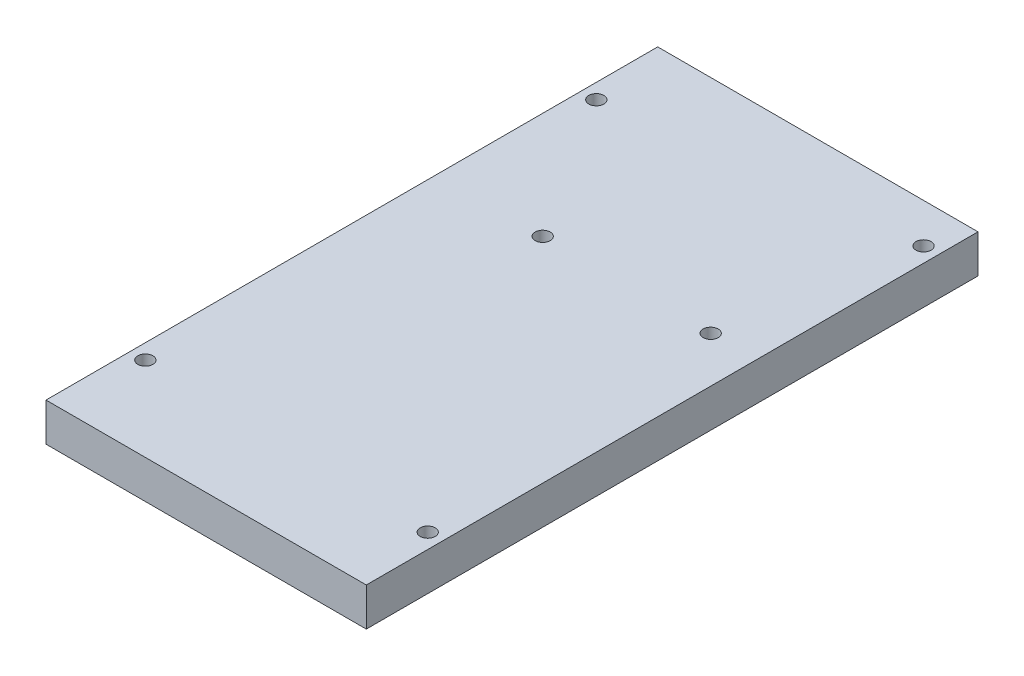
ISO-10303-21;
HEADER;
FILE_DESCRIPTION(('STEP AP214'),'2;1');
FILE_NAME('part.step','',(''),(''),'','','');
FILE_SCHEMA(('AUTOMOTIVE_DESIGN { 1 0 10303 214 1 1 1 1 }'));
ENDSEC;
DATA;
#1=APPLICATION_CONTEXT('core data for automotive mechanical design processes');
#2=APPLICATION_PROTOCOL_DEFINITION('international standard','automotive_design',2000,#1);
#3=PRODUCT_CONTEXT('',#1,'mechanical');
#4=PRODUCT('Part','Part','',(#3));
#5=PRODUCT_RELATED_PRODUCT_CATEGORY('part','',(#4));
#6=PRODUCT_DEFINITION_FORMATION('','',#4);
#7=PRODUCT_DEFINITION_CONTEXT('part definition',#1,'design');
#8=PRODUCT_DEFINITION('design','',#6,#7);
#9=PRODUCT_DEFINITION_SHAPE('','',#8);
#10=(LENGTH_UNIT() NAMED_UNIT(*) SI_UNIT(.MILLI.,.METRE.));
#11=(NAMED_UNIT(*) PLANE_ANGLE_UNIT() SI_UNIT($,.RADIAN.));
#12=(NAMED_UNIT(*) SI_UNIT($,.STERADIAN.) SOLID_ANGLE_UNIT());
#13=UNCERTAINTY_MEASURE_WITH_UNIT(LENGTH_MEASURE(1.E-05),#10,'distance_accuracy_value','');
#14=(GEOMETRIC_REPRESENTATION_CONTEXT(3) GLOBAL_UNCERTAINTY_ASSIGNED_CONTEXT((#13)) GLOBAL_UNIT_ASSIGNED_CONTEXT((#10,
#11,#12)) REPRESENTATION_CONTEXT('',''));
#15=CARTESIAN_POINT('',(0.,0.,0.));
#16=DIRECTION('',(0.,0.,1.));
#17=DIRECTION('',(1.,0.,0.));
#18=AXIS2_PLACEMENT_3D('',#15,#16,#17);
#19=CARTESIAN_POINT('',(0.,6.35,0.));
#20=DIRECTION('',(0.,1.,0.));
#21=DIRECTION('',(0.,0.,1.));
#22=AXIS2_PLACEMENT_3D('',#19,#20,#21);
#23=PLANE('',#22);
#24=CARTESIAN_POINT('',(-50.7,6.35,-14.));
#25=DIRECTION('',(0.,1.,0.));
#26=DIRECTION('',(0.,0.,1.));
#27=AXIS2_PLACEMENT_3D('',#24,#25,#26);
#28=CIRCLE('',#27,1.25);
#29=CARTESIAN_POINT('',(-50.7,6.35,-12.75));
#30=VERTEX_POINT('',#29);
#31=EDGE_CURVE('E133',#30,#30,#28,.T.);
#32=ORIENTED_EDGE('',*,*,#31,.F.);
#33=EDGE_LOOP('',(#32));
#34=FACE_BOUND('',#33,.T.);
#35=CARTESIAN_POINT('',(-35.5,6.35,-64.8));
#36=DIRECTION('',(0.,1.,0.));
#37=DIRECTION('',(0.,0.,1.));
#38=AXIS2_PLACEMENT_3D('',#35,#36,#37);
#39=CIRCLE('',#38,1.25);
#40=CARTESIAN_POINT('',(-35.5,6.35,-63.55));
#41=VERTEX_POINT('',#40);
#42=EDGE_CURVE('E121',#41,#41,#39,.T.);
#43=ORIENTED_EDGE('',*,*,#42,.F.);
#44=EDGE_LOOP('',(#43));
#45=FACE_BOUND('',#44,.T.);
#46=CARTESIAN_POINT('',(-50.7,6.35,-88.9));
#47=DIRECTION('',(0.,1.,0.));
#48=DIRECTION('',(0.,0.,1.));
#49=AXIS2_PLACEMENT_3D('',#46,#47,#48);
#50=CIRCLE('',#49,1.25);
#51=CARTESIAN_POINT('',(-50.7,6.35,-87.65));
#52=VERTEX_POINT('',#51);
#53=EDGE_CURVE('E100',#52,#52,#50,.T.);
#54=ORIENTED_EDGE('',*,*,#53,.F.);
#55=EDGE_LOOP('',(#54));
#56=FACE_BOUND('',#55,.T.);
#57=DIRECTION('',(0.,0.,1.));
#58=VECTOR('',#57,1.);
#59=CARTESIAN_POINT('',(-53.2,6.35,-101.6));
#60=LINE('',#59,#58);
#61=CARTESIAN_POINT('',(-53.2,6.35,-101.6));
#62=VERTEX_POINT('',#61);
#63=CARTESIAN_POINT('',(-53.2,6.35,0.));
#64=VERTEX_POINT('',#63);
#65=EDGE_CURVE('E85',#62,#64,#60,.T.);
#66=ORIENTED_EDGE('',*,*,#65,.T.);
#67=DIRECTION('',(1.,0.,0.));
#68=VECTOR('',#67,1.);
#69=CARTESIAN_POINT('',(-53.2,6.35,0.));
#70=LINE('',#69,#68);
#71=CARTESIAN_POINT('',(0.,6.35,0.));
#72=VERTEX_POINT('',#71);
#73=EDGE_CURVE('E80',#64,#72,#70,.T.);
#74=ORIENTED_EDGE('',*,*,#73,.T.);
#75=DIRECTION('',(0.,0.,-1.));
#76=VECTOR('',#75,1.);
#77=CARTESIAN_POINT('',(0.,6.35,-101.6));
#78=LINE('',#77,#76);
#79=CARTESIAN_POINT('',(0.,6.35,-101.6));
#80=VERTEX_POINT('',#79);
#81=EDGE_CURVE('E83',#72,#80,#78,.T.);
#82=ORIENTED_EDGE('',*,*,#81,.T.);
#83=DIRECTION('',(-1.,0.,0.));
#84=VECTOR('',#83,1.);
#85=CARTESIAN_POINT('',(-53.2,6.35,-101.6));
#86=LINE('',#85,#84);
#87=EDGE_CURVE('E50',#80,#62,#86,.T.);
#88=ORIENTED_EDGE('',*,*,#87,.T.);
#89=EDGE_LOOP('',(#66,#74,#82,#88));
#90=FACE_BOUND('',#89,.T.);
#91=CARTESIAN_POINT('',(-2.5,6.35,-95.05));
#92=DIRECTION('',(0.,1.,0.));
#93=DIRECTION('',(0.,0.,1.));
#94=AXIS2_PLACEMENT_3D('',#91,#92,#93);
#95=CIRCLE('',#94,1.25);
#96=CARTESIAN_POINT('',(-2.5,6.35,-93.8));
#97=VERTEX_POINT('',#96);
#98=EDGE_CURVE('E115',#97,#97,#95,.T.);
#99=ORIENTED_EDGE('',*,*,#98,.F.);
#100=EDGE_LOOP('',(#99));
#101=FACE_BOUND('',#100,.T.);
#102=CARTESIAN_POINT('',(-7.6,6.35,-64.8));
#103=DIRECTION('',(0.,1.,0.));
#104=DIRECTION('',(0.,0.,1.));
#105=AXIS2_PLACEMENT_3D('',#102,#103,#104);
#106=CIRCLE('',#105,1.25);
#107=CARTESIAN_POINT('',(-7.6,6.35,-63.55));
#108=VERTEX_POINT('',#107);
#109=EDGE_CURVE('E127',#108,#108,#106,.T.);
#110=ORIENTED_EDGE('',*,*,#109,.F.);
#111=EDGE_LOOP('',(#110));
#112=FACE_BOUND('',#111,.T.);
#113=CARTESIAN_POINT('',(-2.49999999999999,6.35,-12.7));
#114=DIRECTION('',(0.,1.,0.));
#115=DIRECTION('',(0.,0.,1.));
#116=AXIS2_PLACEMENT_3D('',#113,#114,#115);
#117=CIRCLE('',#116,1.25);
#118=CARTESIAN_POINT('',(-2.49999999999999,6.35,-11.45));
#119=VERTEX_POINT('',#118);
#120=EDGE_CURVE('E139',#119,#119,#117,.T.);
#121=ORIENTED_EDGE('',*,*,#120,.F.);
#122=EDGE_LOOP('',(#121));
#123=FACE_BOUND('',#122,.T.);
#124=ADVANCED_FACE('F33',(#34,#45,#56,#90,#101,#112,#123),#23,.T.);
#125=CARTESIAN_POINT('',(0.,0.,0.));
#126=DIRECTION('',(0.,1.,0.));
#127=DIRECTION('',(0.,0.,1.));
#128=AXIS2_PLACEMENT_3D('',#125,#126,#127);
#129=PLANE('',#128);
#130=CARTESIAN_POINT('',(-50.7,0.,-14.));
#131=DIRECTION('',(0.,1.,0.));
#132=DIRECTION('',(0.,0.,1.));
#133=AXIS2_PLACEMENT_3D('',#130,#131,#132);
#134=CIRCLE('',#133,1.25);
#135=CARTESIAN_POINT('',(-50.7,0.,-12.75));
#136=VERTEX_POINT('',#135);
#137=EDGE_CURVE('E136',#136,#136,#134,.T.);
#138=ORIENTED_EDGE('',*,*,#137,.T.);
#139=EDGE_LOOP('',(#138));
#140=FACE_BOUND('',#139,.T.);
#141=CARTESIAN_POINT('',(-35.5,0.,-64.8));
#142=DIRECTION('',(0.,1.,0.));
#143=DIRECTION('',(0.,0.,1.));
#144=AXIS2_PLACEMENT_3D('',#141,#142,#143);
#145=CIRCLE('',#144,1.25);
#146=CARTESIAN_POINT('',(-35.5,0.,-63.55));
#147=VERTEX_POINT('',#146);
#148=EDGE_CURVE('E124',#147,#147,#145,.T.);
#149=ORIENTED_EDGE('',*,*,#148,.T.);
#150=EDGE_LOOP('',(#149));
#151=FACE_BOUND('',#150,.T.);
#152=CARTESIAN_POINT('',(-50.7,0.,-88.9));
#153=DIRECTION('',(0.,1.,0.));
#154=DIRECTION('',(0.,0.,1.));
#155=AXIS2_PLACEMENT_3D('',#152,#153,#154);
#156=CIRCLE('',#155,1.25);
#157=CARTESIAN_POINT('',(-50.7,0.,-87.65));
#158=VERTEX_POINT('',#157);
#159=EDGE_CURVE('E112',#158,#158,#156,.T.);
#160=ORIENTED_EDGE('',*,*,#159,.T.);
#161=EDGE_LOOP('',(#160));
#162=FACE_BOUND('',#161,.T.);
#163=DIRECTION('',(0.,0.,1.));
#164=VECTOR('',#163,1.);
#165=CARTESIAN_POINT('',(-53.2,0.,-101.6));
#166=LINE('',#165,#164);
#167=CARTESIAN_POINT('',(-53.2,0.,-101.6));
#168=VERTEX_POINT('',#167);
#169=CARTESIAN_POINT('',(-53.2,0.,0.));
#170=VERTEX_POINT('',#169);
#171=EDGE_CURVE('E97',#168,#170,#166,.T.);
#172=ORIENTED_EDGE('',*,*,#171,.F.);
#173=DIRECTION('',(-1.,0.,0.));
#174=VECTOR('',#173,1.);
#175=CARTESIAN_POINT('',(-53.2,0.,-101.6));
#176=LINE('',#175,#174);
#177=CARTESIAN_POINT('',(0.,0.,-101.6));
#178=VERTEX_POINT('',#177);
#179=EDGE_CURVE('E73',#178,#168,#176,.T.);
#180=ORIENTED_EDGE('',*,*,#179,.F.);
#181=DIRECTION('',(0.,0.,-1.));
#182=VECTOR('',#181,1.);
#183=CARTESIAN_POINT('',(0.,0.,-101.6));
#184=LINE('',#183,#182);
#185=CARTESIAN_POINT('',(0.,0.,0.));
#186=VERTEX_POINT('',#185);
#187=EDGE_CURVE('E67',#186,#178,#184,.T.);
#188=ORIENTED_EDGE('',*,*,#187,.F.);
#189=DIRECTION('',(1.,0.,0.));
#190=VECTOR('',#189,1.);
#191=CARTESIAN_POINT('',(-53.2,0.,0.));
#192=LINE('',#191,#190);
#193=EDGE_CURVE('E89',#170,#186,#192,.T.);
#194=ORIENTED_EDGE('',*,*,#193,.F.);
#195=EDGE_LOOP('',(#172,#180,#188,#194));
#196=FACE_BOUND('',#195,.T.);
#197=CARTESIAN_POINT('',(-2.5,0.,-95.05));
#198=DIRECTION('',(0.,1.,0.));
#199=DIRECTION('',(0.,0.,1.));
#200=AXIS2_PLACEMENT_3D('',#197,#198,#199);
#201=CIRCLE('',#200,1.25);
#202=CARTESIAN_POINT('',(-2.5,0.,-93.8));
#203=VERTEX_POINT('',#202);
#204=EDGE_CURVE('E118',#203,#203,#201,.T.);
#205=ORIENTED_EDGE('',*,*,#204,.T.);
#206=EDGE_LOOP('',(#205));
#207=FACE_BOUND('',#206,.T.);
#208=CARTESIAN_POINT('',(-7.6,0.,-64.8));
#209=DIRECTION('',(0.,1.,0.));
#210=DIRECTION('',(0.,0.,1.));
#211=AXIS2_PLACEMENT_3D('',#208,#209,#210);
#212=CIRCLE('',#211,1.25);
#213=CARTESIAN_POINT('',(-7.6,0.,-63.55));
#214=VERTEX_POINT('',#213);
#215=EDGE_CURVE('E130',#214,#214,#212,.T.);
#216=ORIENTED_EDGE('',*,*,#215,.T.);
#217=EDGE_LOOP('',(#216));
#218=FACE_BOUND('',#217,.T.);
#219=CARTESIAN_POINT('',(-2.49999999999999,0.,-12.7));
#220=DIRECTION('',(0.,1.,0.));
#221=DIRECTION('',(0.,0.,1.));
#222=AXIS2_PLACEMENT_3D('',#219,#220,#221);
#223=CIRCLE('',#222,1.25);
#224=CARTESIAN_POINT('',(-2.49999999999999,0.,-11.45));
#225=VERTEX_POINT('',#224);
#226=EDGE_CURVE('E142',#225,#225,#223,.T.);
#227=ORIENTED_EDGE('',*,*,#226,.T.);
#228=EDGE_LOOP('',(#227));
#229=FACE_BOUND('',#228,.T.);
#230=ADVANCED_FACE('F108',(#140,#151,#162,#196,#207,#218,#229),#129,.F.);
#231=CARTESIAN_POINT('',(-53.2,6.35,-101.6));
#232=DIRECTION('',(1.,0.,0.));
#233=DIRECTION('',(0.,0.,-1.));
#234=AXIS2_PLACEMENT_3D('',#231,#232,#233);
#235=PLANE('',#234);
#236=ORIENTED_EDGE('',*,*,#171,.T.);
#237=DIRECTION('',(0.,-1.,0.));
#238=VECTOR('',#237,1.);
#239=CARTESIAN_POINT('',(-53.2,6.35,0.));
#240=LINE('',#239,#238);
#241=EDGE_CURVE('E11',#64,#170,#240,.T.);
#242=ORIENTED_EDGE('',*,*,#241,.F.);
#243=ORIENTED_EDGE('',*,*,#65,.F.);
#244=DIRECTION('',(0.,-1.,0.));
#245=VECTOR('',#244,1.);
#246=CARTESIAN_POINT('',(-53.2,6.35,-101.6));
#247=LINE('',#246,#245);
#248=EDGE_CURVE('E93',#62,#168,#247,.T.);
#249=ORIENTED_EDGE('',*,*,#248,.T.);
#250=EDGE_LOOP('',(#236,#242,#243,#249));
#251=FACE_BOUND('',#250,.T.);
#252=ADVANCED_FACE('F35',(#251),#235,.F.);
#253=CARTESIAN_POINT('',(-53.2,6.35,0.));
#254=DIRECTION('',(0.,0.,-1.));
#255=DIRECTION('',(-1.,0.,0.));
#256=AXIS2_PLACEMENT_3D('',#253,#254,#255);
#257=PLANE('',#256);
#258=ORIENTED_EDGE('',*,*,#193,.T.);
#259=DIRECTION('',(0.,-1.,0.));
#260=VECTOR('',#259,1.);
#261=CARTESIAN_POINT('',(0.,6.35,0.));
#262=LINE('',#261,#260);
#263=EDGE_CURVE('E42',#72,#186,#262,.T.);
#264=ORIENTED_EDGE('',*,*,#263,.F.);
#265=ORIENTED_EDGE('',*,*,#73,.F.);
#266=ORIENTED_EDGE('',*,*,#241,.T.);
#267=EDGE_LOOP('',(#258,#264,#265,#266));
#268=FACE_BOUND('',#267,.T.);
#269=ADVANCED_FACE('F88',(#268),#257,.F.);
#270=CARTESIAN_POINT('',(0.,6.35,-101.6));
#271=DIRECTION('',(-1.,0.,0.));
#272=DIRECTION('',(0.,0.,1.));
#273=AXIS2_PLACEMENT_3D('',#270,#271,#272);
#274=PLANE('',#273);
#275=ORIENTED_EDGE('',*,*,#187,.T.);
#276=DIRECTION('',(0.,-1.,0.));
#277=VECTOR('',#276,1.);
#278=CARTESIAN_POINT('',(0.,6.35,-101.6));
#279=LINE('',#278,#277);
#280=EDGE_CURVE('E90',#80,#178,#279,.T.);
#281=ORIENTED_EDGE('',*,*,#280,.F.);
#282=ORIENTED_EDGE('',*,*,#81,.F.);
#283=ORIENTED_EDGE('',*,*,#263,.T.);
#284=EDGE_LOOP('',(#275,#281,#282,#283));
#285=FACE_BOUND('',#284,.T.);
#286=ADVANCED_FACE('F91',(#285),#274,.F.);
#287=CARTESIAN_POINT('',(-53.2,6.35,-101.6));
#288=DIRECTION('',(0.,0.,1.));
#289=DIRECTION('',(1.,0.,0.));
#290=AXIS2_PLACEMENT_3D('',#287,#288,#289);
#291=PLANE('',#290);
#292=ORIENTED_EDGE('',*,*,#179,.T.);
#293=ORIENTED_EDGE('',*,*,#248,.F.);
#294=ORIENTED_EDGE('',*,*,#87,.F.);
#295=ORIENTED_EDGE('',*,*,#280,.T.);
#296=EDGE_LOOP('',(#292,#293,#294,#295));
#297=FACE_BOUND('',#296,.T.);
#298=ADVANCED_FACE('F105',(#297),#291,.F.);
#299=CARTESIAN_POINT('',(-50.7,6.35,-88.9));
#300=DIRECTION('',(0.,-1.,0.));
#301=DIRECTION('',(0.,0.,-1.));
#302=AXIS2_PLACEMENT_3D('',#299,#300,#301);
#303=CYLINDRICAL_SURFACE('',#302,1.25);
#304=ORIENTED_EDGE('',*,*,#53,.T.);
#305=EDGE_LOOP('',(#304));
#306=FACE_BOUND('',#305,.T.);
#307=ORIENTED_EDGE('',*,*,#159,.F.);
#308=EDGE_LOOP('',(#307));
#309=FACE_BOUND('',#308,.T.);
#310=ADVANCED_FACE('F162',(#306,#309),#303,.F.);
#311=CARTESIAN_POINT('',(-2.5,6.35,-95.05));
#312=DIRECTION('',(0.,-1.,0.));
#313=DIRECTION('',(0.,0.,-1.));
#314=AXIS2_PLACEMENT_3D('',#311,#312,#313);
#315=CYLINDRICAL_SURFACE('',#314,1.25);
#316=ORIENTED_EDGE('',*,*,#98,.T.);
#317=EDGE_LOOP('',(#316));
#318=FACE_BOUND('',#317,.T.);
#319=ORIENTED_EDGE('',*,*,#204,.F.);
#320=EDGE_LOOP('',(#319));
#321=FACE_BOUND('',#320,.T.);
#322=ADVANCED_FACE('F208',(#318,#321),#315,.F.);
#323=CARTESIAN_POINT('',(-35.5,6.35,-64.8));
#324=DIRECTION('',(0.,-1.,0.));
#325=DIRECTION('',(0.,0.,-1.));
#326=AXIS2_PLACEMENT_3D('',#323,#324,#325);
#327=CYLINDRICAL_SURFACE('',#326,1.25);
#328=ORIENTED_EDGE('',*,*,#42,.T.);
#329=EDGE_LOOP('',(#328));
#330=FACE_BOUND('',#329,.T.);
#331=ORIENTED_EDGE('',*,*,#148,.F.);
#332=EDGE_LOOP('',(#331));
#333=FACE_BOUND('',#332,.T.);
#334=ADVANCED_FACE('F216',(#330,#333),#327,.F.);
#335=CARTESIAN_POINT('',(-7.6,6.35,-64.8));
#336=DIRECTION('',(0.,-1.,0.));
#337=DIRECTION('',(0.,0.,-1.));
#338=AXIS2_PLACEMENT_3D('',#335,#336,#337);
#339=CYLINDRICAL_SURFACE('',#338,1.25);
#340=ORIENTED_EDGE('',*,*,#109,.T.);
#341=EDGE_LOOP('',(#340));
#342=FACE_BOUND('',#341,.T.);
#343=ORIENTED_EDGE('',*,*,#215,.F.);
#344=EDGE_LOOP('',(#343));
#345=FACE_BOUND('',#344,.T.);
#346=ADVANCED_FACE('F224',(#342,#345),#339,.F.);
#347=CARTESIAN_POINT('',(-50.7,6.35,-14.));
#348=DIRECTION('',(0.,-1.,0.));
#349=DIRECTION('',(0.,0.,-1.));
#350=AXIS2_PLACEMENT_3D('',#347,#348,#349);
#351=CYLINDRICAL_SURFACE('',#350,1.25);
#352=ORIENTED_EDGE('',*,*,#31,.T.);
#353=EDGE_LOOP('',(#352));
#354=FACE_BOUND('',#353,.T.);
#355=ORIENTED_EDGE('',*,*,#137,.F.);
#356=EDGE_LOOP('',(#355));
#357=FACE_BOUND('',#356,.T.);
#358=ADVANCED_FACE('F233',(#354,#357),#351,.F.);
#359=CARTESIAN_POINT('',(-2.49999999999999,6.35,-12.7));
#360=DIRECTION('',(0.,-1.,0.));
#361=DIRECTION('',(0.,0.,-1.));
#362=AXIS2_PLACEMENT_3D('',#359,#360,#361);
#363=CYLINDRICAL_SURFACE('',#362,1.25);
#364=ORIENTED_EDGE('',*,*,#120,.T.);
#365=EDGE_LOOP('',(#364));
#366=FACE_BOUND('',#365,.T.);
#367=ORIENTED_EDGE('',*,*,#226,.F.);
#368=EDGE_LOOP('',(#367));
#369=FACE_BOUND('',#368,.T.);
#370=ADVANCED_FACE('F148',(#366,#369),#363,.F.);
#371=CLOSED_SHELL('',(#124,#230,#252,#269,#286,#298,#310,#322,#334,#346,#358,#370));
#372=MANIFOLD_SOLID_BREP('B2',#371);
#373=ADVANCED_BREP_SHAPE_REPRESENTATION('',(#18,#372),#14);
#374=SHAPE_DEFINITION_REPRESENTATION(#9,#373);
ENDSEC;
END-ISO-10303-21;
